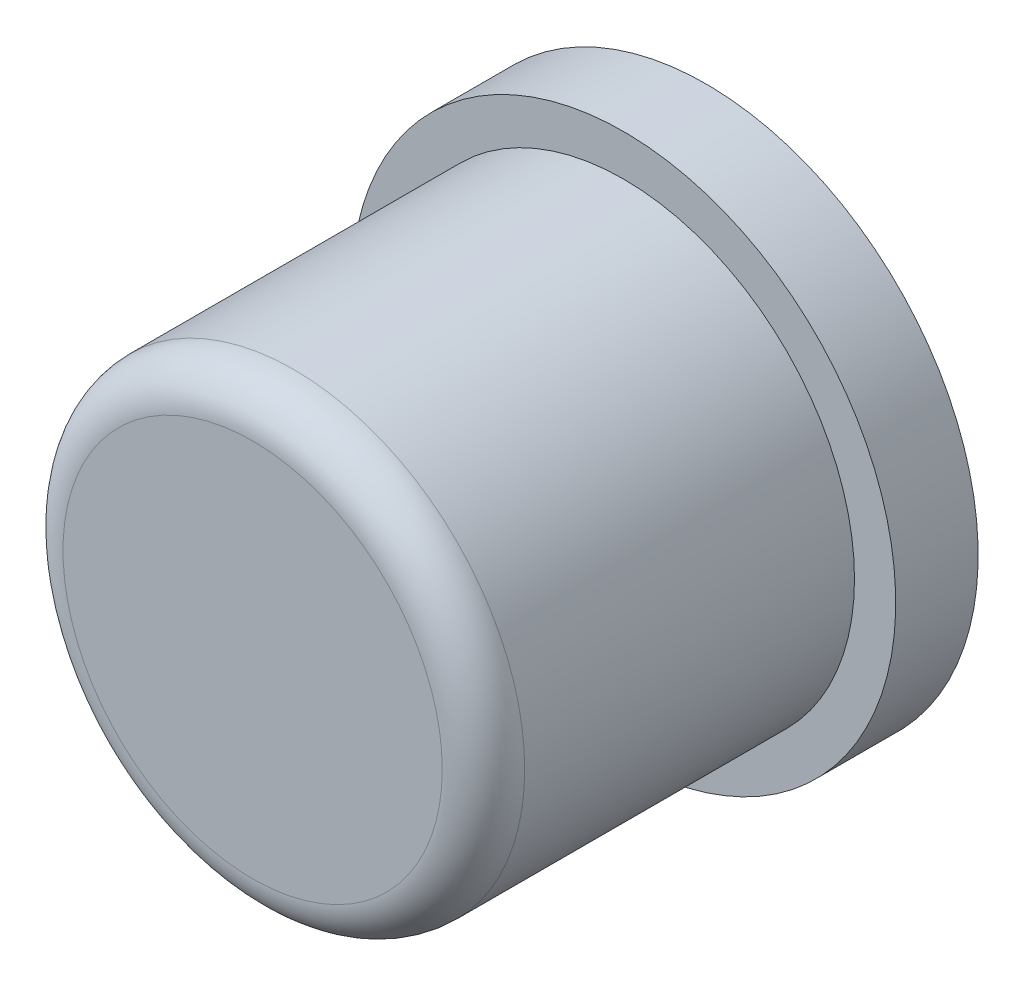
ISO-10303-21;
HEADER;
FILE_DESCRIPTION(('STEP AP214'),'2;1');
FILE_NAME('part.step','',(''),(''),'','','');
FILE_SCHEMA(('AUTOMOTIVE_DESIGN { 1 0 10303 214 1 1 1 1 }'));
ENDSEC;
DATA;
#1=APPLICATION_CONTEXT('core data for automotive mechanical design processes');
#2=APPLICATION_PROTOCOL_DEFINITION('international standard','automotive_design',2000,#1);
#3=PRODUCT_CONTEXT('',#1,'mechanical');
#4=PRODUCT('Part','Part','',(#3));
#5=PRODUCT_RELATED_PRODUCT_CATEGORY('part','',(#4));
#6=PRODUCT_DEFINITION_FORMATION('','',#4);
#7=PRODUCT_DEFINITION_CONTEXT('part definition',#1,'design');
#8=PRODUCT_DEFINITION('design','',#6,#7);
#9=PRODUCT_DEFINITION_SHAPE('','',#8);
#10=(LENGTH_UNIT() NAMED_UNIT(*) SI_UNIT(.MILLI.,.METRE.));
#11=(NAMED_UNIT(*) PLANE_ANGLE_UNIT() SI_UNIT($,.RADIAN.));
#12=(NAMED_UNIT(*) SI_UNIT($,.STERADIAN.) SOLID_ANGLE_UNIT());
#13=UNCERTAINTY_MEASURE_WITH_UNIT(LENGTH_MEASURE(1.E-05),#10,'distance_accuracy_value','');
#14=(GEOMETRIC_REPRESENTATION_CONTEXT(3) GLOBAL_UNCERTAINTY_ASSIGNED_CONTEXT((#13)) GLOBAL_UNIT_ASSIGNED_CONTEXT((#10,
#11,#12)) REPRESENTATION_CONTEXT('',''));
#15=CARTESIAN_POINT('',(0.,0.,0.));
#16=DIRECTION('',(0.,0.,1.));
#17=DIRECTION('',(1.,0.,0.));
#18=AXIS2_PLACEMENT_3D('',#15,#16,#17);
#19=CARTESIAN_POINT('',(0.,0.,5.5));
#20=DIRECTION('',(0.,0.,-1.));
#21=DIRECTION('',(-1.,0.,0.));
#22=AXIS2_PLACEMENT_3D('',#19,#20,#21);
#23=CYLINDRICAL_SURFACE('',#22,2.8);
#24=CARTESIAN_POINT('',(0.,0.,5.));
#25=DIRECTION('',(0.,0.,1.));
#26=DIRECTION('',(1.,0.,0.));
#27=AXIS2_PLACEMENT_3D('',#24,#25,#26);
#28=CIRCLE('',#27,2.8);
#29=CARTESIAN_POINT('',(2.8,0.,5.));
#30=VERTEX_POINT('',#29);
#31=EDGE_CURVE('E10',#30,#30,#28,.F.);
#32=ORIENTED_EDGE('',*,*,#31,.T.);
#33=EDGE_LOOP('',(#32));
#34=FACE_BOUND('',#33,.T.);
#35=CARTESIAN_POINT('',(0.,0.,1.));
#36=DIRECTION('',(0.,0.,-1.));
#37=DIRECTION('',(-1.,0.,0.));
#38=AXIS2_PLACEMENT_3D('',#35,#36,#37);
#39=CIRCLE('',#38,2.8);
#40=CARTESIAN_POINT('',(-2.8,0.,1.));
#41=VERTEX_POINT('',#40);
#42=EDGE_CURVE('E54',#41,#41,#39,.T.);
#43=ORIENTED_EDGE('',*,*,#42,.F.);
#44=EDGE_LOOP('',(#43));
#45=FACE_BOUND('',#44,.T.);
#46=ADVANCED_FACE('F41',(#34,#45),#23,.T.);
#47=CARTESIAN_POINT('',(0.,0.,5.5));
#48=DIRECTION('',(0.,0.,1.));
#49=DIRECTION('',(1.,0.,0.));
#50=AXIS2_PLACEMENT_3D('',#47,#48,#49);
#51=PLANE('',#50);
#52=CARTESIAN_POINT('',(0.,0.,5.5));
#53=DIRECTION('',(0.,0.,1.));
#54=DIRECTION('',(1.,0.,0.));
#55=AXIS2_PLACEMENT_3D('',#52,#53,#54);
#56=CIRCLE('',#55,2.3);
#57=CARTESIAN_POINT('',(2.3,0.,5.5));
#58=VERTEX_POINT('',#57);
#59=EDGE_CURVE('E49',#58,#58,#56,.T.);
#60=ORIENTED_EDGE('',*,*,#59,.T.);
#61=EDGE_LOOP('',(#60));
#62=FACE_BOUND('',#61,.T.);
#63=ADVANCED_FACE('F95',(#62),#51,.T.);
#64=CARTESIAN_POINT('',(0.,0.,1.));
#65=DIRECTION('',(0.,0.,-1.));
#66=DIRECTION('',(-1.,0.,0.));
#67=AXIS2_PLACEMENT_3D('',#64,#65,#66);
#68=CYLINDRICAL_SURFACE('',#67,3.3);
#69=CARTESIAN_POINT('',(0.,0.,1.));
#70=DIRECTION('',(0.,0.,-1.));
#71=DIRECTION('',(-1.,0.,0.));
#72=AXIS2_PLACEMENT_3D('',#69,#70,#71);
#73=CIRCLE('',#72,3.3);
#74=CARTESIAN_POINT('',(-3.3,0.,1.));
#75=VERTEX_POINT('',#74);
#76=EDGE_CURVE('E59',#75,#75,#73,.T.);
#77=ORIENTED_EDGE('',*,*,#76,.T.);
#78=EDGE_LOOP('',(#77));
#79=FACE_BOUND('',#78,.T.);
#80=CARTESIAN_POINT('',(0.,0.,0.));
#81=DIRECTION('',(0.,0.,-1.));
#82=DIRECTION('',(-1.,0.,0.));
#83=AXIS2_PLACEMENT_3D('',#80,#81,#82);
#84=CIRCLE('',#83,3.3);
#85=CARTESIAN_POINT('',(-3.3,0.,0.));
#86=VERTEX_POINT('',#85);
#87=EDGE_CURVE('E62',#86,#86,#84,.T.);
#88=ORIENTED_EDGE('',*,*,#87,.F.);
#89=EDGE_LOOP('',(#88));
#90=FACE_BOUND('',#89,.T.);
#91=ADVANCED_FACE('F93',(#79,#90),#68,.T.);
#92=CARTESIAN_POINT('',(0.,0.,1.));
#93=DIRECTION('',(0.,0.,-1.));
#94=DIRECTION('',(-1.,0.,0.));
#95=AXIS2_PLACEMENT_3D('',#92,#93,#94);
#96=PLANE('',#95);
#97=ORIENTED_EDGE('',*,*,#42,.T.);
#98=EDGE_LOOP('',(#97));
#99=FACE_BOUND('',#98,.T.);
#100=ORIENTED_EDGE('',*,*,#76,.F.);
#101=EDGE_LOOP('',(#100));
#102=FACE_BOUND('',#101,.T.);
#103=ADVANCED_FACE('F89',(#99,#102),#96,.F.);
#104=CARTESIAN_POINT('',(0.,0.,0.));
#105=DIRECTION('',(0.,0.,1.));
#106=DIRECTION('',(1.,0.,0.));
#107=AXIS2_PLACEMENT_3D('',#104,#105,#106);
#108=PLANE('',#107);
#109=CARTESIAN_POINT('',(0.,0.,0.));
#110=DIRECTION('',(0.,0.,-1.));
#111=DIRECTION('',(-1.,0.,0.));
#112=AXIS2_PLACEMENT_3D('',#109,#110,#111);
#113=CIRCLE('',#112,2.);
#114=CARTESIAN_POINT('',(-2.,0.,0.));
#115=VERTEX_POINT('',#114);
#116=EDGE_CURVE('E70',#115,#115,#113,.T.);
#117=ORIENTED_EDGE('',*,*,#116,.F.);
#118=EDGE_LOOP('',(#117));
#119=FACE_BOUND('',#118,.T.);
#120=ORIENTED_EDGE('',*,*,#87,.T.);
#121=EDGE_LOOP('',(#120));
#122=FACE_BOUND('',#121,.T.);
#123=ADVANCED_FACE('F83',(#119,#122),#108,.F.);
#124=CARTESIAN_POINT('',(0.,0.,0.5));
#125=DIRECTION('',(0.,0.,-1.));
#126=DIRECTION('',(-1.,0.,0.));
#127=AXIS2_PLACEMENT_3D('',#124,#125,#126);
#128=CYLINDRICAL_SURFACE('',#127,2.);
#129=CARTESIAN_POINT('',(0.,0.,0.5));
#130=DIRECTION('',(0.,0.,-1.));
#131=DIRECTION('',(-1.,0.,0.));
#132=AXIS2_PLACEMENT_3D('',#129,#130,#131);
#133=CIRCLE('',#132,2.);
#134=CARTESIAN_POINT('',(-2.,0.,0.5));
#135=VERTEX_POINT('',#134);
#136=EDGE_CURVE('E66',#135,#135,#133,.T.);
#137=ORIENTED_EDGE('',*,*,#136,.F.);
#138=EDGE_LOOP('',(#137));
#139=FACE_BOUND('',#138,.T.);
#140=ORIENTED_EDGE('',*,*,#116,.T.);
#141=EDGE_LOOP('',(#140));
#142=FACE_BOUND('',#141,.T.);
#143=ADVANCED_FACE('F80',(#139,#142),#128,.F.);
#144=CARTESIAN_POINT('',(0.,0.,0.5));
#145=DIRECTION('',(0.,0.,-1.));
#146=DIRECTION('',(-1.,0.,0.));
#147=AXIS2_PLACEMENT_3D('',#144,#145,#146);
#148=PLANE('',#147);
#149=ORIENTED_EDGE('',*,*,#136,.T.);
#150=EDGE_LOOP('',(#149));
#151=FACE_BOUND('',#150,.T.);
#152=ADVANCED_FACE('F78',(#151),#148,.T.);
#153=CARTESIAN_POINT('',(0.,0.,5.));
#154=DIRECTION('',(0.,0.,1.));
#155=DIRECTION('',(1.,0.,0.));
#156=AXIS2_PLACEMENT_3D('',#153,#154,#155);
#157=TOROIDAL_SURFACE('',#156,2.3,0.5);
#158=ORIENTED_EDGE('',*,*,#31,.F.);
#159=EDGE_LOOP('',(#158));
#160=FACE_BOUND('',#159,.T.);
#161=ORIENTED_EDGE('',*,*,#59,.F.);
#162=EDGE_LOOP('',(#161));
#163=FACE_BOUND('',#162,.T.);
#164=ADVANCED_FACE('F43',(#160,#163),#157,.T.);
#165=CLOSED_SHELL('',(#46,#63,#91,#103,#123,#143,#152,#164));
#166=MANIFOLD_SOLID_BREP('B2',#165);
#167=ADVANCED_BREP_SHAPE_REPRESENTATION('',(#18,#166),#14);
#168=SHAPE_DEFINITION_REPRESENTATION(#9,#167);
ENDSEC;
END-ISO-10303-21;
